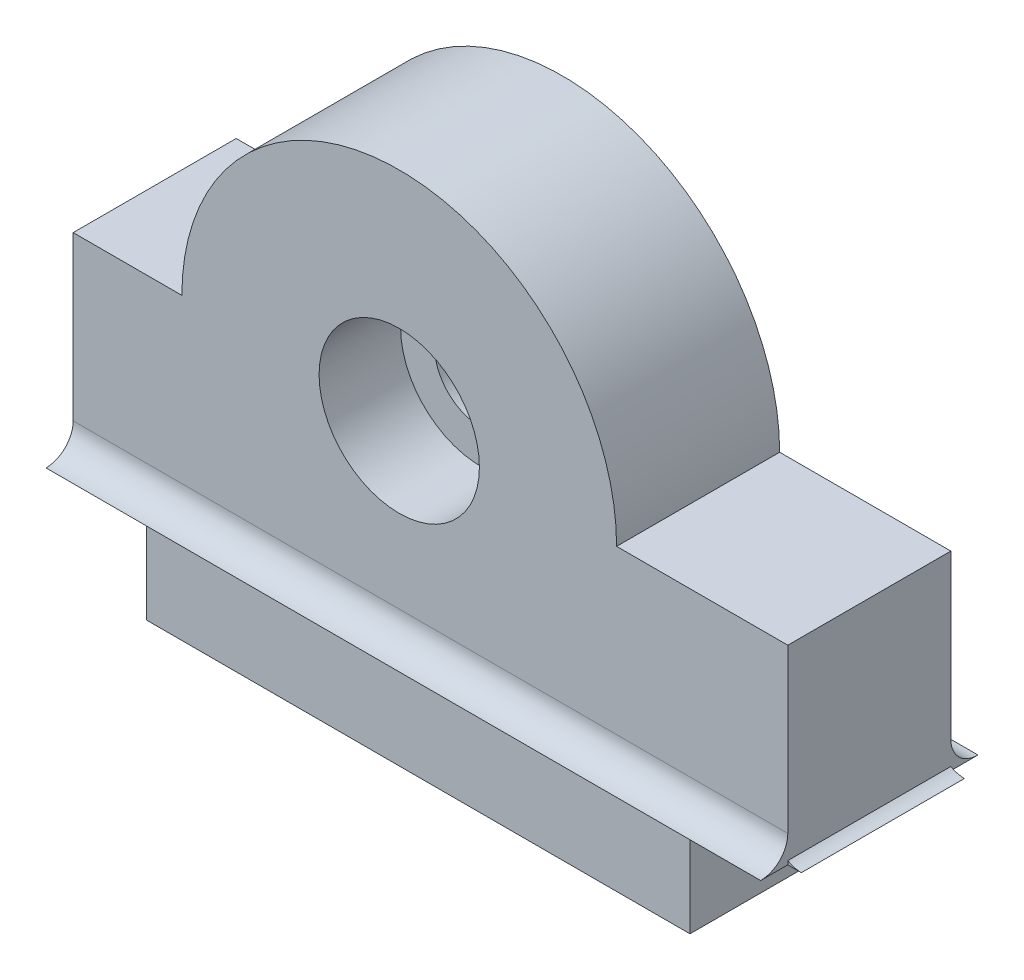
ISO-10303-21;
HEADER;
FILE_DESCRIPTION(('STEP AP214'),'2;1');
FILE_NAME('part.step','',(''),(''),'','','');
FILE_SCHEMA(('AUTOMOTIVE_DESIGN { 1 0 10303 214 1 1 1 1 }'));
ENDSEC;
DATA;
#1=APPLICATION_CONTEXT('core data for automotive mechanical design processes');
#2=APPLICATION_PROTOCOL_DEFINITION('international standard','automotive_design',2000,#1);
#3=PRODUCT_CONTEXT('',#1,'mechanical');
#4=PRODUCT('Part','Part','',(#3));
#5=PRODUCT_RELATED_PRODUCT_CATEGORY('part','',(#4));
#6=PRODUCT_DEFINITION_FORMATION('','',#4);
#7=PRODUCT_DEFINITION_CONTEXT('part definition',#1,'design');
#8=PRODUCT_DEFINITION('design','',#6,#7);
#9=PRODUCT_DEFINITION_SHAPE('','',#8);
#10=(LENGTH_UNIT() NAMED_UNIT(*) SI_UNIT(.MILLI.,.METRE.));
#11=(NAMED_UNIT(*) PLANE_ANGLE_UNIT() SI_UNIT($,.RADIAN.));
#12=(NAMED_UNIT(*) SI_UNIT($,.STERADIAN.) SOLID_ANGLE_UNIT());
#13=UNCERTAINTY_MEASURE_WITH_UNIT(LENGTH_MEASURE(1.E-05),#10,'distance_accuracy_value','');
#14=(GEOMETRIC_REPRESENTATION_CONTEXT(3) GLOBAL_UNCERTAINTY_ASSIGNED_CONTEXT((#13)) GLOBAL_UNIT_ASSIGNED_CONTEXT((#10,
#11,#12)) REPRESENTATION_CONTEXT('',''));
#15=CARTESIAN_POINT('',(0.,0.,0.));
#16=DIRECTION('',(0.,0.,1.));
#17=DIRECTION('',(1.,0.,0.));
#18=AXIS2_PLACEMENT_3D('',#15,#16,#17);
#19=CARTESIAN_POINT('',(9.3,11.,6.));
#20=DIRECTION('',(0.,0.,-1.));
#21=DIRECTION('',(-1.,0.,0.));
#22=AXIS2_PLACEMENT_3D('',#19,#20,#21);
#23=CYLINDRICAL_SURFACE('',#22,2.95);
#24=CARTESIAN_POINT('',(9.3,11.,6.));
#25=DIRECTION('',(0.,0.,1.));
#26=DIRECTION('',(1.,0.,0.));
#27=AXIS2_PLACEMENT_3D('',#24,#25,#26);
#28=CIRCLE('',#27,2.95);
#29=CARTESIAN_POINT('',(12.25,11.,6.));
#30=VERTEX_POINT('',#29);
#31=EDGE_CURVE('E214',#30,#30,#28,.T.);
#32=ORIENTED_EDGE('',*,*,#31,.T.);
#33=EDGE_LOOP('',(#32));
#34=FACE_BOUND('',#33,.T.);
#35=CARTESIAN_POINT('',(9.3,11.,3.));
#36=DIRECTION('',(0.,0.,-1.));
#37=DIRECTION('',(-1.,0.,0.));
#38=AXIS2_PLACEMENT_3D('',#35,#36,#37);
#39=CIRCLE('',#38,2.95);
#40=CARTESIAN_POINT('',(6.34999999999999,11.,3.));
#41=VERTEX_POINT('',#40);
#42=EDGE_CURVE('E159',#41,#41,#39,.T.);
#43=ORIENTED_EDGE('',*,*,#42,.T.);
#44=EDGE_LOOP('',(#43));
#45=FACE_BOUND('',#44,.T.);
#46=ADVANCED_FACE('F32',(#34,#45),#23,.F.);
#47=CARTESIAN_POINT('',(9.3,11.,0.));
#48=DIRECTION('',(0.,0.,1.));
#49=DIRECTION('',(1.,0.,0.));
#50=AXIS2_PLACEMENT_3D('',#47,#48,#49);
#51=PLANE('',#50);
#52=DIRECTION('',(-1.,0.,0.));
#53=VECTOR('',#52,1.);
#54=CARTESIAN_POINT('',(25.0142135623731,5.,0.));
#55=LINE('',#54,#53);
#56=CARTESIAN_POINT('',(23.6,5.,0.));
#57=VERTEX_POINT('',#56);
#58=CARTESIAN_POINT('',(23.1,5.,0.));
#59=VERTEX_POINT('',#58);
#60=EDGE_CURVE('E188',#57,#59,#55,.T.);
#61=ORIENTED_EDGE('',*,*,#60,.T.);
#62=CARTESIAN_POINT('',(-1.49999999999999,5.,0.));
#63=VERTEX_POINT('',#62);
#64=EDGE_CURVE('E194',#59,#63,#55,.T.);
#65=ORIENTED_EDGE('',*,*,#64,.T.);
#66=CARTESIAN_POINT('',(-2.7,5.,0.));
#67=VERTEX_POINT('',#66);
#68=EDGE_CURVE('E55',#63,#67,#55,.T.);
#69=ORIENTED_EDGE('',*,*,#68,.T.);
#70=DIRECTION('',(0.,-1.,0.));
#71=VECTOR('',#70,1.);
#72=CARTESIAN_POINT('',(-2.7,4.,0.));
#73=LINE('',#72,#71);
#74=CARTESIAN_POINT('',(-2.70000000000001,11.,0.));
#75=VERTEX_POINT('',#74);
#76=EDGE_CURVE('E222',#75,#67,#73,.T.);
#77=ORIENTED_EDGE('',*,*,#76,.F.);
#78=DIRECTION('',(-1.,0.,0.));
#79=VECTOR('',#78,1.);
#80=CARTESIAN_POINT('',(-2.70000000000001,11.,0.));
#81=LINE('',#80,#79);
#82=CARTESIAN_POINT('',(1.29999999999999,11.,0.));
#83=VERTEX_POINT('',#82);
#84=EDGE_CURVE('E250',#83,#75,#81,.T.);
#85=ORIENTED_EDGE('',*,*,#84,.F.);
#86=CARTESIAN_POINT('',(9.3,11.,0.));
#87=DIRECTION('',(0.,0.,1.));
#88=DIRECTION('',(1.,0.,0.));
#89=AXIS2_PLACEMENT_3D('',#86,#87,#88);
#90=CIRCLE('',#89,8.);
#91=CARTESIAN_POINT('',(17.3,11.,0.));
#92=VERTEX_POINT('',#91);
#93=EDGE_CURVE('E248',#92,#83,#90,.T.);
#94=ORIENTED_EDGE('',*,*,#93,.F.);
#95=DIRECTION('',(-1.,0.,0.));
#96=VECTOR('',#95,1.);
#97=CARTESIAN_POINT('',(17.3,11.,0.));
#98=LINE('',#97,#96);
#99=CARTESIAN_POINT('',(23.6,11.,0.));
#100=VERTEX_POINT('',#99);
#101=EDGE_CURVE('E246',#100,#92,#98,.T.);
#102=ORIENTED_EDGE('',*,*,#101,.F.);
#103=DIRECTION('',(0.,1.,0.));
#104=VECTOR('',#103,1.);
#105=CARTESIAN_POINT('',(23.6,11.,0.));
#106=LINE('',#105,#104);
#107=EDGE_CURVE('E244',#57,#100,#106,.T.);
#108=ORIENTED_EDGE('',*,*,#107,.F.);
#109=EDGE_LOOP('',(#61,#65,#69,#77,#85,#94,#102,#108));
#110=FACE_BOUND('',#109,.T.);
#111=CARTESIAN_POINT('',(9.3,11.,0.));
#112=DIRECTION('',(0.,0.,-1.));
#113=DIRECTION('',(-1.,0.,0.));
#114=AXIS2_PLACEMENT_3D('',#111,#112,#113);
#115=CIRCLE('',#114,1.7);
#116=CARTESIAN_POINT('',(7.6,11.,0.));
#117=VERTEX_POINT('',#116);
#118=EDGE_CURVE('E358',#117,#117,#115,.T.);
#119=ORIENTED_EDGE('',*,*,#118,.F.);
#120=EDGE_LOOP('',(#119));
#121=FACE_BOUND('',#120,.T.);
#122=ADVANCED_FACE('F302',(#110,#121),#51,.F.);
#123=CARTESIAN_POINT('',(9.3,11.,6.));
#124=DIRECTION('',(0.,0.,1.));
#125=DIRECTION('',(1.,0.,0.));
#126=AXIS2_PLACEMENT_3D('',#123,#124,#125);
#127=PLANE('',#126);
#128=ORIENTED_EDGE('',*,*,#31,.F.);
#129=EDGE_LOOP('',(#128));
#130=FACE_BOUND('',#129,.T.);
#131=DIRECTION('',(0.,-1.,0.));
#132=VECTOR('',#131,1.);
#133=CARTESIAN_POINT('',(-2.7,4.,6.));
#134=LINE('',#133,#132);
#135=CARTESIAN_POINT('',(-2.70000000000001,11.,6.));
#136=VERTEX_POINT('',#135);
#137=CARTESIAN_POINT('',(-2.7,5.,6.));
#138=VERTEX_POINT('',#137);
#139=EDGE_CURVE('E234',#136,#138,#134,.T.);
#140=ORIENTED_EDGE('',*,*,#139,.T.);
#141=DIRECTION('',(-1.,0.,0.));
#142=VECTOR('',#141,1.);
#143=CARTESIAN_POINT('',(25.0142135623731,5.,6.));
#144=LINE('',#143,#142);
#145=CARTESIAN_POINT('',(-1.49999999999999,5.,6.));
#146=VERTEX_POINT('',#145);
#147=EDGE_CURVE('E47',#146,#138,#144,.T.);
#148=ORIENTED_EDGE('',*,*,#147,.F.);
#149=CARTESIAN_POINT('',(23.1,5.,6.));
#150=VERTEX_POINT('',#149);
#151=EDGE_CURVE('E209',#150,#146,#144,.T.);
#152=ORIENTED_EDGE('',*,*,#151,.F.);
#153=CARTESIAN_POINT('',(23.6,5.,6.));
#154=VERTEX_POINT('',#153);
#155=EDGE_CURVE('E206',#154,#150,#144,.T.);
#156=ORIENTED_EDGE('',*,*,#155,.F.);
#157=DIRECTION('',(0.,1.,0.));
#158=VECTOR('',#157,1.);
#159=CARTESIAN_POINT('',(23.6,11.,6.));
#160=LINE('',#159,#158);
#161=CARTESIAN_POINT('',(23.6,11.,6.));
#162=VERTEX_POINT('',#161);
#163=EDGE_CURVE('E226',#154,#162,#160,.T.);
#164=ORIENTED_EDGE('',*,*,#163,.T.);
#165=DIRECTION('',(-1.,0.,0.));
#166=VECTOR('',#165,1.);
#167=CARTESIAN_POINT('',(17.3,11.,6.));
#168=LINE('',#167,#166);
#169=CARTESIAN_POINT('',(17.3,11.,6.));
#170=VERTEX_POINT('',#169);
#171=EDGE_CURVE('E228',#162,#170,#168,.T.);
#172=ORIENTED_EDGE('',*,*,#171,.T.);
#173=CARTESIAN_POINT('',(9.3,11.,6.));
#174=DIRECTION('',(0.,0.,1.));
#175=DIRECTION('',(1.,0.,0.));
#176=AXIS2_PLACEMENT_3D('',#173,#174,#175);
#177=CIRCLE('',#176,8.);
#178=CARTESIAN_POINT('',(1.29999999999999,11.,6.));
#179=VERTEX_POINT('',#178);
#180=EDGE_CURVE('E230',#170,#179,#177,.T.);
#181=ORIENTED_EDGE('',*,*,#180,.T.);
#182=DIRECTION('',(-1.,0.,0.));
#183=VECTOR('',#182,1.);
#184=CARTESIAN_POINT('',(-2.70000000000001,11.,6.));
#185=LINE('',#184,#183);
#186=EDGE_CURVE('E232',#179,#136,#185,.T.);
#187=ORIENTED_EDGE('',*,*,#186,.T.);
#188=EDGE_LOOP('',(#140,#148,#152,#156,#164,#172,#181,#187));
#189=FACE_BOUND('',#188,.T.);
#190=ADVANCED_FACE('F308',(#130,#189),#127,.T.);
#191=DIRECTION('',(-1.,0.,0.));
#192=VECTOR('',#191,1.);
#193=CARTESIAN_POINT('',(25.0142135623731,4.,6.));
#194=LINE('',#193,#192);
#195=CARTESIAN_POINT('',(20.,4.,6.));
#196=VERTEX_POINT('',#195);
#197=CARTESIAN_POINT('',(0.,4.,6.));
#198=VERTEX_POINT('',#197);
#199=EDGE_CURVE('E202',#196,#198,#194,.T.);
#200=ORIENTED_EDGE('',*,*,#199,.T.);
#201=DIRECTION('',(0.,-1.,0.));
#202=VECTOR('',#201,1.);
#203=CARTESIAN_POINT('',(0.,0.,6.));
#204=LINE('',#203,#202);
#205=CARTESIAN_POINT('',(0.,0.,6.));
#206=VERTEX_POINT('',#205);
#207=EDGE_CURVE('E218',#198,#206,#204,.T.);
#208=ORIENTED_EDGE('',*,*,#207,.T.);
#209=DIRECTION('',(1.,0.,0.));
#210=VECTOR('',#209,1.);
#211=CARTESIAN_POINT('',(0.,0.,6.));
#212=LINE('',#211,#210);
#213=CARTESIAN_POINT('',(20.,0.,6.));
#214=VERTEX_POINT('',#213);
#215=EDGE_CURVE('E221',#206,#214,#212,.T.);
#216=ORIENTED_EDGE('',*,*,#215,.T.);
#217=DIRECTION('',(0.,1.,0.));
#218=VECTOR('',#217,1.);
#219=CARTESIAN_POINT('',(20.,0.,6.));
#220=LINE('',#219,#218);
#221=EDGE_CURVE('E224',#214,#196,#220,.T.);
#222=ORIENTED_EDGE('',*,*,#221,.T.);
#223=EDGE_LOOP('',(#200,#208,#216,#222));
#224=FACE_BOUND('',#223,.T.);
#225=ADVANCED_FACE('F292',(#224),#127,.T.);
#226=DIRECTION('',(0.,-1.,0.));
#227=VECTOR('',#226,1.);
#228=CARTESIAN_POINT('',(0.,0.,0.));
#229=LINE('',#228,#227);
#230=CARTESIAN_POINT('',(0.,4.,0.));
#231=VERTEX_POINT('',#230);
#232=CARTESIAN_POINT('',(0.,0.,0.));
#233=VERTEX_POINT('',#232);
#234=EDGE_CURVE('E217',#231,#233,#229,.T.);
#235=ORIENTED_EDGE('',*,*,#234,.F.);
#236=DIRECTION('',(-1.,0.,0.));
#237=VECTOR('',#236,1.);
#238=CARTESIAN_POINT('',(25.0142135623731,4.,0.));
#239=LINE('',#238,#237);
#240=CARTESIAN_POINT('',(20.,4.,0.));
#241=VERTEX_POINT('',#240);
#242=EDGE_CURVE('E195',#241,#231,#239,.T.);
#243=ORIENTED_EDGE('',*,*,#242,.F.);
#244=DIRECTION('',(0.,1.,0.));
#245=VECTOR('',#244,1.);
#246=CARTESIAN_POINT('',(20.,0.,0.));
#247=LINE('',#246,#245);
#248=CARTESIAN_POINT('',(20.,0.,0.));
#249=VERTEX_POINT('',#248);
#250=EDGE_CURVE('E241',#249,#241,#247,.T.);
#251=ORIENTED_EDGE('',*,*,#250,.F.);
#252=DIRECTION('',(1.,0.,0.));
#253=VECTOR('',#252,1.);
#254=CARTESIAN_POINT('',(0.,0.,0.));
#255=LINE('',#254,#253);
#256=EDGE_CURVE('E239',#233,#249,#255,.T.);
#257=ORIENTED_EDGE('',*,*,#256,.F.);
#258=EDGE_LOOP('',(#235,#243,#251,#257));
#259=FACE_BOUND('',#258,.T.);
#260=ADVANCED_FACE('F285',(#259),#51,.F.);
#261=CARTESIAN_POINT('',(0.,0.,6.));
#262=DIRECTION('',(1.,0.,0.));
#263=DIRECTION('',(0.,0.,-1.));
#264=AXIS2_PLACEMENT_3D('',#261,#262,#263);
#265=PLANE('',#264);
#266=ORIENTED_EDGE('',*,*,#234,.T.);
#267=DIRECTION('',(0.,0.,-1.));
#268=VECTOR('',#267,1.);
#269=CARTESIAN_POINT('',(0.,0.,6.));
#270=LINE('',#269,#268);
#271=EDGE_CURVE('E11',#206,#233,#270,.T.);
#272=ORIENTED_EDGE('',*,*,#271,.F.);
#273=ORIENTED_EDGE('',*,*,#207,.F.);
#274=DIRECTION('',(0.,0.,-1.));
#275=VECTOR('',#274,1.);
#276=CARTESIAN_POINT('',(0.,4.,6.));
#277=LINE('',#276,#275);
#278=EDGE_CURVE('E236',#198,#231,#277,.T.);
#279=ORIENTED_EDGE('',*,*,#278,.T.);
#280=EDGE_LOOP('',(#266,#272,#273,#279));
#281=FACE_BOUND('',#280,.T.);
#282=ADVANCED_FACE('F34',(#281),#265,.F.);
#283=CARTESIAN_POINT('',(0.,0.,6.));
#284=DIRECTION('',(0.,1.,0.));
#285=DIRECTION('',(0.,0.,1.));
#286=AXIS2_PLACEMENT_3D('',#283,#284,#285);
#287=PLANE('',#286);
#288=ORIENTED_EDGE('',*,*,#256,.T.);
#289=DIRECTION('',(0.,0.,-1.));
#290=VECTOR('',#289,1.);
#291=CARTESIAN_POINT('',(20.,0.,6.));
#292=LINE('',#291,#290);
#293=EDGE_CURVE('E40',#214,#249,#292,.T.);
#294=ORIENTED_EDGE('',*,*,#293,.F.);
#295=ORIENTED_EDGE('',*,*,#215,.F.);
#296=ORIENTED_EDGE('',*,*,#271,.T.);
#297=EDGE_LOOP('',(#288,#294,#295,#296));
#298=FACE_BOUND('',#297,.T.);
#299=ADVANCED_FACE('F293',(#298),#287,.F.);
#300=CARTESIAN_POINT('',(20.,0.,6.));
#301=DIRECTION('',(-1.,0.,0.));
#302=DIRECTION('',(0.,0.,1.));
#303=AXIS2_PLACEMENT_3D('',#300,#301,#302);
#304=PLANE('',#303);
#305=ORIENTED_EDGE('',*,*,#250,.T.);
#306=DIRECTION('',(0.,0.,-1.));
#307=VECTOR('',#306,1.);
#308=CARTESIAN_POINT('',(20.,4.,6.));
#309=LINE('',#308,#307);
#310=EDGE_CURVE('E273',#196,#241,#309,.T.);
#311=ORIENTED_EDGE('',*,*,#310,.F.);
#312=ORIENTED_EDGE('',*,*,#221,.F.);
#313=ORIENTED_EDGE('',*,*,#293,.T.);
#314=EDGE_LOOP('',(#305,#311,#312,#313));
#315=FACE_BOUND('',#314,.T.);
#316=ADVANCED_FACE('F280',(#315),#304,.F.);
#317=CARTESIAN_POINT('',(23.6,11.,6.));
#318=DIRECTION('',(-1.,0.,0.));
#319=DIRECTION('',(0.,-1.,0.));
#320=AXIS2_PLACEMENT_3D('',#317,#318,#319);
#321=PLANE('',#320);
#322=DIRECTION('',(0.,0.,-1.));
#323=VECTOR('',#322,1.);
#324=CARTESIAN_POINT('',(23.6,4.,6.));
#325=LINE('',#324,#323);
#326=CARTESIAN_POINT('',(23.6,4.,7.));
#327=VERTEX_POINT('',#326);
#328=CARTESIAN_POINT('',(23.6,4.,6.));
#329=VERTEX_POINT('',#328);
#330=EDGE_CURVE('E271',#327,#329,#325,.T.);
#331=ORIENTED_EDGE('',*,*,#330,.T.);
#332=DIRECTION('',(0.,1.,0.));
#333=VECTOR('',#332,1.);
#334=CARTESIAN_POINT('',(23.6,11.,6.));
#335=LINE('',#334,#333);
#336=CARTESIAN_POINT('',(23.6,4.13397459621557,6.));
#337=VERTEX_POINT('',#336);
#338=EDGE_CURVE('E157',#329,#337,#335,.T.);
#339=ORIENTED_EDGE('',*,*,#338,.T.);
#340=DIRECTION('',(0.,0.,1.));
#341=VECTOR('',#340,1.);
#342=CARTESIAN_POINT('',(23.6,4.13397459621557,-1.4142135623731));
#343=LINE('',#342,#341);
#344=CARTESIAN_POINT('',(23.6,4.13397459621557,0.));
#345=VERTEX_POINT('',#344);
#346=EDGE_CURVE('E173',#337,#345,#343,.F.);
#347=ORIENTED_EDGE('',*,*,#346,.T.);
#348=DIRECTION('',(0.,1.,0.));
#349=VECTOR('',#348,1.);
#350=CARTESIAN_POINT('',(23.6,11.,0.));
#351=LINE('',#350,#349);
#352=CARTESIAN_POINT('',(23.6,4.,0.));
#353=VERTEX_POINT('',#352);
#354=EDGE_CURVE('E179',#353,#345,#351,.T.);
#355=ORIENTED_EDGE('',*,*,#354,.F.);
#356=CARTESIAN_POINT('',(23.6,4.,-1.));
#357=VERTEX_POINT('',#356);
#358=EDGE_CURVE('E270',#353,#357,#325,.T.);
#359=ORIENTED_EDGE('',*,*,#358,.T.);
#360=CARTESIAN_POINT('',(23.6,5.,-1.));
#361=DIRECTION('',(-1.,0.,0.));
#362=DIRECTION('',(0.,-1.,0.));
#363=AXIS2_PLACEMENT_3D('',#360,#361,#362);
#364=CIRCLE('',#363,1.);
#365=EDGE_CURVE('E185',#357,#57,#364,.T.);
#366=ORIENTED_EDGE('',*,*,#365,.T.);
#367=ORIENTED_EDGE('',*,*,#107,.T.);
#368=DIRECTION('',(0.,0.,-1.));
#369=VECTOR('',#368,1.);
#370=CARTESIAN_POINT('',(23.6,11.,6.));
#371=LINE('',#370,#369);
#372=EDGE_CURVE('E267',#162,#100,#371,.T.);
#373=ORIENTED_EDGE('',*,*,#372,.F.);
#374=ORIENTED_EDGE('',*,*,#163,.F.);
#375=CARTESIAN_POINT('',(23.6,5.,7.));
#376=DIRECTION('',(-1.,0.,0.));
#377=DIRECTION('',(0.,-1.,0.));
#378=AXIS2_PLACEMENT_3D('',#375,#376,#377);
#379=CIRCLE('',#378,1.);
#380=EDGE_CURVE('E205',#154,#327,#379,.T.);
#381=ORIENTED_EDGE('',*,*,#380,.T.);
#382=EDGE_LOOP('',(#331,#339,#347,#355,#359,#366,#367,#373,#374,#381));
#383=FACE_BOUND('',#382,.T.);
#384=ADVANCED_FACE('F299',(#383),#321,.F.);
#385=CARTESIAN_POINT('',(17.3,11.,6.));
#386=DIRECTION('',(0.,-1.,0.));
#387=DIRECTION('',(0.,0.,-1.));
#388=AXIS2_PLACEMENT_3D('',#385,#386,#387);
#389=PLANE('',#388);
#390=ORIENTED_EDGE('',*,*,#101,.T.);
#391=DIRECTION('',(0.,0.,-1.));
#392=VECTOR('',#391,1.);
#393=CARTESIAN_POINT('',(17.3,11.,6.));
#394=LINE('',#393,#392);
#395=EDGE_CURVE('E264',#170,#92,#394,.T.);
#396=ORIENTED_EDGE('',*,*,#395,.F.);
#397=ORIENTED_EDGE('',*,*,#171,.F.);
#398=ORIENTED_EDGE('',*,*,#372,.T.);
#399=EDGE_LOOP('',(#390,#396,#397,#398));
#400=FACE_BOUND('',#399,.T.);
#401=ADVANCED_FACE('F332',(#400),#389,.F.);
#402=CARTESIAN_POINT('',(9.3,11.,6.));
#403=DIRECTION('',(0.,0.,-1.));
#404=DIRECTION('',(-1.,0.,0.));
#405=AXIS2_PLACEMENT_3D('',#402,#403,#404);
#406=CYLINDRICAL_SURFACE('',#405,8.);
#407=ORIENTED_EDGE('',*,*,#93,.T.);
#408=DIRECTION('',(0.,0.,-1.));
#409=VECTOR('',#408,1.);
#410=CARTESIAN_POINT('',(1.29999999999999,11.,6.));
#411=LINE('',#410,#409);
#412=EDGE_CURVE('E261',#179,#83,#411,.T.);
#413=ORIENTED_EDGE('',*,*,#412,.F.);
#414=ORIENTED_EDGE('',*,*,#180,.F.);
#415=ORIENTED_EDGE('',*,*,#395,.T.);
#416=EDGE_LOOP('',(#407,#413,#414,#415));
#417=FACE_BOUND('',#416,.T.);
#418=ADVANCED_FACE('F328',(#417),#406,.T.);
#419=CARTESIAN_POINT('',(-2.70000000000001,11.,6.));
#420=DIRECTION('',(0.,-1.,0.));
#421=DIRECTION('',(0.,0.,-1.));
#422=AXIS2_PLACEMENT_3D('',#419,#420,#421);
#423=PLANE('',#422);
#424=ORIENTED_EDGE('',*,*,#84,.T.);
#425=DIRECTION('',(0.,0.,-1.));
#426=VECTOR('',#425,1.);
#427=CARTESIAN_POINT('',(-2.70000000000001,11.,6.));
#428=LINE('',#427,#426);
#429=EDGE_CURVE('E258',#136,#75,#428,.T.);
#430=ORIENTED_EDGE('',*,*,#429,.F.);
#431=ORIENTED_EDGE('',*,*,#186,.F.);
#432=ORIENTED_EDGE('',*,*,#412,.T.);
#433=EDGE_LOOP('',(#424,#430,#431,#432));
#434=FACE_BOUND('',#433,.T.);
#435=ADVANCED_FACE('F324',(#434),#423,.F.);
#436=CARTESIAN_POINT('',(-2.7,4.,6.));
#437=DIRECTION('',(1.,0.,0.));
#438=DIRECTION('',(0.,1.,0.));
#439=AXIS2_PLACEMENT_3D('',#436,#437,#438);
#440=PLANE('',#439);
#441=ORIENTED_EDGE('',*,*,#76,.T.);
#442=CARTESIAN_POINT('',(-2.7,5.,-1.));
#443=DIRECTION('',(1.,0.,0.));
#444=DIRECTION('',(0.,0.,-1.));
#445=AXIS2_PLACEMENT_3D('',#442,#443,#444);
#446=CIRCLE('',#445,1.);
#447=CARTESIAN_POINT('',(-2.7,4.,-1.));
#448=VERTEX_POINT('',#447);
#449=EDGE_CURVE('E184',#67,#448,#446,.T.);
#450=ORIENTED_EDGE('',*,*,#449,.T.);
#451=DIRECTION('',(0.,0.,-1.));
#452=VECTOR('',#451,1.);
#453=CARTESIAN_POINT('',(-2.7,4.,6.));
#454=LINE('',#453,#452);
#455=CARTESIAN_POINT('',(-2.7,4.,7.));
#456=VERTEX_POINT('',#455);
#457=EDGE_CURVE('E256',#456,#448,#454,.T.);
#458=ORIENTED_EDGE('',*,*,#457,.F.);
#459=CARTESIAN_POINT('',(-2.7,5.,7.));
#460=DIRECTION('',(1.,0.,0.));
#461=DIRECTION('',(0.,0.,1.));
#462=AXIS2_PLACEMENT_3D('',#459,#460,#461);
#463=CIRCLE('',#462,1.);
#464=EDGE_CURVE('E187',#456,#138,#463,.T.);
#465=ORIENTED_EDGE('',*,*,#464,.T.);
#466=ORIENTED_EDGE('',*,*,#139,.F.);
#467=ORIENTED_EDGE('',*,*,#429,.T.);
#468=EDGE_LOOP('',(#441,#450,#458,#465,#466,#467));
#469=FACE_BOUND('',#468,.T.);
#470=ADVANCED_FACE('F321',(#469),#440,.F.);
#471=CARTESIAN_POINT('',(0.,4.,6.));
#472=DIRECTION('',(0.,1.,0.));
#473=DIRECTION('',(0.,0.,1.));
#474=AXIS2_PLACEMENT_3D('',#471,#472,#473);
#475=PLANE('',#474);
#476=ORIENTED_EDGE('',*,*,#242,.T.);
#477=ORIENTED_EDGE('',*,*,#278,.F.);
#478=ORIENTED_EDGE('',*,*,#199,.F.);
#479=ORIENTED_EDGE('',*,*,#310,.T.);
#480=EDGE_LOOP('',(#476,#477,#478,#479));
#481=FACE_BOUND('',#480,.T.);
#482=ORIENTED_EDGE('',*,*,#358,.F.);
#483=DIRECTION('',(-1.,0.,0.));
#484=VECTOR('',#483,1.);
#485=CARTESIAN_POINT('',(23.1,4.,0.));
#486=LINE('',#485,#484);
#487=CARTESIAN_POINT('',(24.1,4.,0.));
#488=VERTEX_POINT('',#487);
#489=EDGE_CURVE('E167',#488,#353,#486,.T.);
#490=ORIENTED_EDGE('',*,*,#489,.F.);
#491=DIRECTION('',(0.,0.,1.));
#492=VECTOR('',#491,1.);
#493=CARTESIAN_POINT('',(24.1,4.,-1.4142135623731));
#494=LINE('',#493,#492);
#495=CARTESIAN_POINT('',(24.1,4.,6.));
#496=VERTEX_POINT('',#495);
#497=EDGE_CURVE('E163',#488,#496,#494,.T.);
#498=ORIENTED_EDGE('',*,*,#497,.T.);
#499=DIRECTION('',(1.,0.,0.));
#500=VECTOR('',#499,1.);
#501=CARTESIAN_POINT('',(23.1,4.,6.));
#502=LINE('',#501,#500);
#503=EDGE_CURVE('E152',#329,#496,#502,.T.);
#504=ORIENTED_EDGE('',*,*,#503,.F.);
#505=ORIENTED_EDGE('',*,*,#330,.F.);
#506=DIRECTION('',(-1.,0.,0.));
#507=VECTOR('',#506,1.);
#508=CARTESIAN_POINT('',(25.0142135623731,4.,7.));
#509=LINE('',#508,#507);
#510=EDGE_CURVE('E201',#327,#456,#509,.T.);
#511=ORIENTED_EDGE('',*,*,#510,.T.);
#512=ORIENTED_EDGE('',*,*,#457,.T.);
#513=DIRECTION('',(-1.,0.,0.));
#514=VECTOR('',#513,1.);
#515=CARTESIAN_POINT('',(25.0142135623731,4.,-1.));
#516=LINE('',#515,#514);
#517=EDGE_CURVE('E191',#357,#448,#516,.T.);
#518=ORIENTED_EDGE('',*,*,#517,.F.);
#519=EDGE_LOOP('',(#482,#490,#498,#504,#505,#511,#512,#518));
#520=FACE_BOUND('',#519,.T.);
#521=ADVANCED_FACE('F165',(#481,#520),#475,.F.);
#522=CARTESIAN_POINT('',(25.0142135623731,5.,7.));
#523=DIRECTION('',(-1.,0.,0.));
#524=DIRECTION('',(0.,0.,1.));
#525=AXIS2_PLACEMENT_3D('',#522,#523,#524);
#526=CYLINDRICAL_SURFACE('',#525,1.);
#527=ORIENTED_EDGE('',*,*,#380,.F.);
#528=ORIENTED_EDGE('',*,*,#155,.T.);
#529=ORIENTED_EDGE('',*,*,#151,.T.);
#530=ORIENTED_EDGE('',*,*,#147,.T.);
#531=ORIENTED_EDGE('',*,*,#464,.F.);
#532=ORIENTED_EDGE('',*,*,#510,.F.);
#533=EDGE_LOOP('',(#527,#528,#529,#530,#531,#532));
#534=FACE_BOUND('',#533,.T.);
#535=ADVANCED_FACE('F314',(#534),#526,.F.);
#536=CARTESIAN_POINT('',(25.0142135623731,5.,-1.));
#537=DIRECTION('',(-1.,0.,0.));
#538=DIRECTION('',(0.,0.,1.));
#539=AXIS2_PLACEMENT_3D('',#536,#537,#538);
#540=CYLINDRICAL_SURFACE('',#539,1.);
#541=ORIENTED_EDGE('',*,*,#365,.F.);
#542=ORIENTED_EDGE('',*,*,#517,.T.);
#543=ORIENTED_EDGE('',*,*,#449,.F.);
#544=ORIENTED_EDGE('',*,*,#68,.F.);
#545=ORIENTED_EDGE('',*,*,#64,.F.);
#546=ORIENTED_EDGE('',*,*,#60,.F.);
#547=EDGE_LOOP('',(#541,#542,#543,#544,#545,#546));
#548=FACE_BOUND('',#547,.T.);
#549=ADVANCED_FACE('F350',(#548),#540,.F.);
#550=CARTESIAN_POINT('',(24.1,5.,6.));
#551=DIRECTION('',(0.,0.,1.));
#552=DIRECTION('',(1.,0.,0.));
#553=AXIS2_PLACEMENT_3D('',#550,#551,#552);
#554=PLANE('',#553);
#555=ORIENTED_EDGE('',*,*,#338,.F.);
#556=ORIENTED_EDGE('',*,*,#503,.T.);
#557=CARTESIAN_POINT('',(24.1,5.,6.));
#558=DIRECTION('',(0.,0.,-1.));
#559=DIRECTION('',(1.,0.,0.));
#560=AXIS2_PLACEMENT_3D('',#557,#558,#559);
#561=CIRCLE('',#560,1.);
#562=EDGE_CURVE('E156',#496,#337,#561,.T.);
#563=ORIENTED_EDGE('',*,*,#562,.T.);
#564=EDGE_LOOP('',(#555,#556,#563));
#565=FACE_BOUND('',#564,.T.);
#566=ADVANCED_FACE('F154',(#565),#554,.T.);
#567=CARTESIAN_POINT('',(24.1,5.,-1.4142135623731));
#568=DIRECTION('',(0.,0.,1.));
#569=DIRECTION('',(1.,0.,0.));
#570=AXIS2_PLACEMENT_3D('',#567,#568,#569);
#571=CYLINDRICAL_SURFACE('',#570,1.);
#572=ORIENTED_EDGE('',*,*,#346,.F.);
#573=ORIENTED_EDGE('',*,*,#562,.F.);
#574=ORIENTED_EDGE('',*,*,#497,.F.);
#575=CARTESIAN_POINT('',(24.1,5.,0.));
#576=DIRECTION('',(0.,0.,1.));
#577=DIRECTION('',(1.,0.,0.));
#578=AXIS2_PLACEMENT_3D('',#575,#576,#577);
#579=CIRCLE('',#578,1.);
#580=EDGE_CURVE('E177',#345,#488,#579,.T.);
#581=ORIENTED_EDGE('',*,*,#580,.F.);
#582=EDGE_LOOP('',(#572,#573,#574,#581));
#583=FACE_BOUND('',#582,.T.);
#584=ADVANCED_FACE('F172',(#583),#571,.F.);
#585=CARTESIAN_POINT('',(9.3,11.,0.));
#586=DIRECTION('',(0.,0.,1.));
#587=DIRECTION('',(1.,0.,0.));
#588=AXIS2_PLACEMENT_3D('',#585,#586,#587);
#589=PLANE('',#588);
#590=ORIENTED_EDGE('',*,*,#489,.T.);
#591=ORIENTED_EDGE('',*,*,#354,.T.);
#592=ORIENTED_EDGE('',*,*,#580,.T.);
#593=EDGE_LOOP('',(#590,#591,#592));
#594=FACE_BOUND('',#593,.T.);
#595=ADVANCED_FACE('F353',(#594),#589,.F.);
#596=CARTESIAN_POINT('',(9.3,11.,3.));
#597=DIRECTION('',(0.,0.,-1.));
#598=DIRECTION('',(-1.,0.,0.));
#599=AXIS2_PLACEMENT_3D('',#596,#597,#598);
#600=PLANE('',#599);
#601=CARTESIAN_POINT('',(9.3,11.,3.));
#602=DIRECTION('',(0.,0.,-1.));
#603=DIRECTION('',(-1.,0.,0.));
#604=AXIS2_PLACEMENT_3D('',#601,#602,#603);
#605=CIRCLE('',#604,1.7);
#606=CARTESIAN_POINT('',(7.6,11.,3.));
#607=VERTEX_POINT('',#606);
#608=EDGE_CURVE('E357',#607,#607,#605,.T.);
#609=ORIENTED_EDGE('',*,*,#608,.T.);
#610=EDGE_LOOP('',(#609));
#611=FACE_BOUND('',#610,.T.);
#612=ORIENTED_EDGE('',*,*,#42,.F.);
#613=EDGE_LOOP('',(#612));
#614=FACE_BOUND('',#613,.T.);
#615=ADVANCED_FACE('F364',(#611,#614),#600,.F.);
#616=CARTESIAN_POINT('',(9.3,11.,3.));
#617=DIRECTION('',(0.,0.,-1.));
#618=DIRECTION('',(-1.,0.,0.));
#619=AXIS2_PLACEMENT_3D('',#616,#617,#618);
#620=CYLINDRICAL_SURFACE('',#619,1.7);
#621=ORIENTED_EDGE('',*,*,#608,.F.);
#622=EDGE_LOOP('',(#621));
#623=FACE_BOUND('',#622,.T.);
#624=ORIENTED_EDGE('',*,*,#118,.T.);
#625=EDGE_LOOP('',(#624));
#626=FACE_BOUND('',#625,.T.);
#627=ADVANCED_FACE('F367',(#623,#626),#620,.F.);
#628=CLOSED_SHELL('',(#46,#122,#190,#225,#260,#282,#299,#316,#384,#401,#418,#435,#470,#521,#535,
#549,#566,#584,#595,#615,#627));
#629=MANIFOLD_SOLID_BREP('B2',#628);
#630=ADVANCED_BREP_SHAPE_REPRESENTATION('',(#18,#629),#14);
#631=SHAPE_DEFINITION_REPRESENTATION(#9,#630);
ENDSEC;
END-ISO-10303-21;
